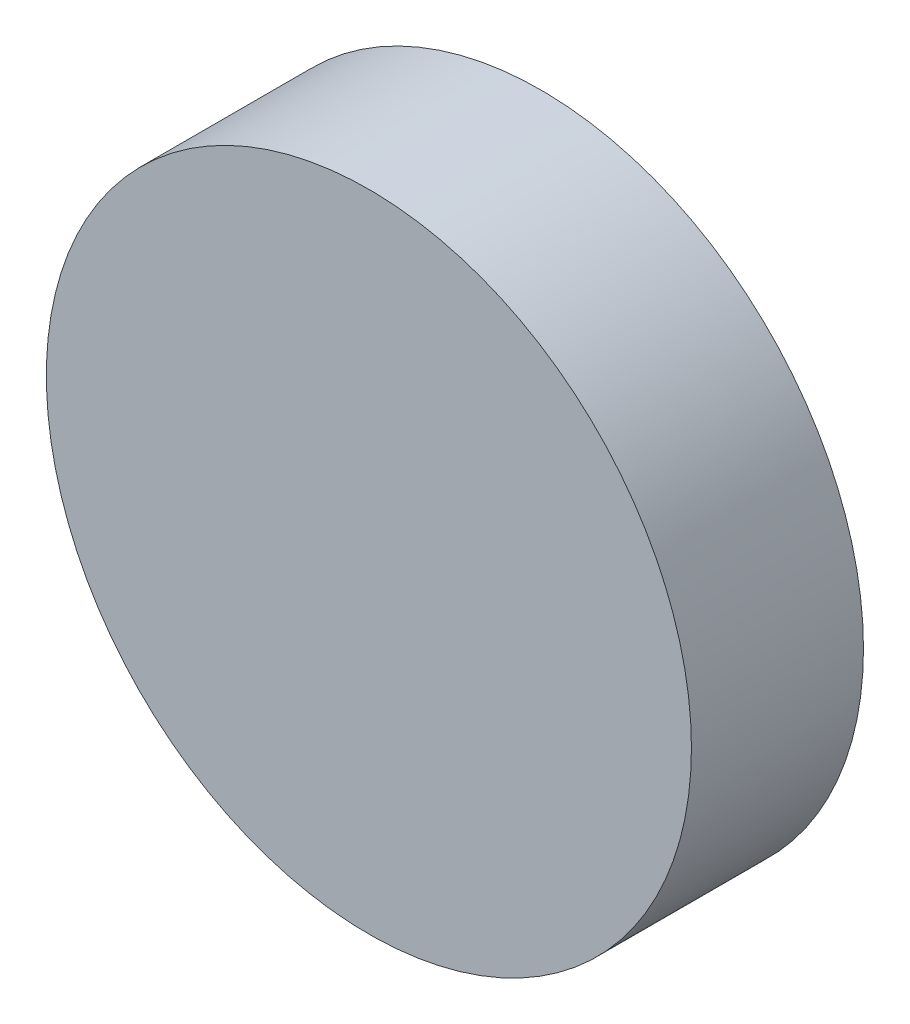
ISO-10303-21;
HEADER;
FILE_DESCRIPTION(('STEP AP214'),'2;1');
FILE_NAME('part.step','',(''),(''),'','','');
FILE_SCHEMA(('AUTOMOTIVE_DESIGN { 1 0 10303 214 1 1 1 1 }'));
ENDSEC;
DATA;
#1=APPLICATION_CONTEXT('core data for automotive mechanical design processes');
#2=APPLICATION_PROTOCOL_DEFINITION('international standard','automotive_design',2000,#1);
#3=PRODUCT_CONTEXT('',#1,'mechanical');
#4=PRODUCT('Part','Part','',(#3));
#5=PRODUCT_RELATED_PRODUCT_CATEGORY('part','',(#4));
#6=PRODUCT_DEFINITION_FORMATION('','',#4);
#7=PRODUCT_DEFINITION_CONTEXT('part definition',#1,'design');
#8=PRODUCT_DEFINITION('design','',#6,#7);
#9=PRODUCT_DEFINITION_SHAPE('','',#8);
#10=(LENGTH_UNIT() NAMED_UNIT(*) SI_UNIT(.MILLI.,.METRE.));
#11=(NAMED_UNIT(*) PLANE_ANGLE_UNIT() SI_UNIT($,.RADIAN.));
#12=(NAMED_UNIT(*) SI_UNIT($,.STERADIAN.) SOLID_ANGLE_UNIT());
#13=UNCERTAINTY_MEASURE_WITH_UNIT(LENGTH_MEASURE(1.E-05),#10,'distance_accuracy_value','');
#14=(GEOMETRIC_REPRESENTATION_CONTEXT(3) GLOBAL_UNCERTAINTY_ASSIGNED_CONTEXT((#13)) GLOBAL_UNIT_ASSIGNED_CONTEXT((#10,
#11,#12)) REPRESENTATION_CONTEXT('',''));
#15=CARTESIAN_POINT('',(0.,0.,0.));
#16=DIRECTION('',(0.,0.,1.));
#17=DIRECTION('',(1.,0.,0.));
#18=AXIS2_PLACEMENT_3D('',#15,#16,#17);
#19=CARTESIAN_POINT('',(0.,0.,2.4));
#20=DIRECTION('',(0.,0.,-1.));
#21=DIRECTION('',(-1.,0.,0.));
#22=AXIS2_PLACEMENT_3D('',#19,#20,#21);
#23=CYLINDRICAL_SURFACE('',#22,4.5);
#24=CARTESIAN_POINT('',(0.,0.,2.4));
#25=DIRECTION('',(0.,0.,1.));
#26=DIRECTION('',(1.,0.,0.));
#27=AXIS2_PLACEMENT_3D('',#24,#25,#26);
#28=CIRCLE('',#27,4.5);
#29=CARTESIAN_POINT('',(4.5,0.,2.4));
#30=VERTEX_POINT('',#29);
#31=EDGE_CURVE('E10',#30,#30,#28,.T.);
#32=ORIENTED_EDGE('',*,*,#31,.F.);
#33=EDGE_LOOP('',(#32));
#34=FACE_BOUND('',#33,.T.);
#35=CARTESIAN_POINT('',(0.,0.,0.));
#36=DIRECTION('',(0.,0.,1.));
#37=DIRECTION('',(1.,0.,0.));
#38=AXIS2_PLACEMENT_3D('',#35,#36,#37);
#39=CIRCLE('',#38,4.5);
#40=CARTESIAN_POINT('',(4.5,0.,0.));
#41=VERTEX_POINT('',#40);
#42=EDGE_CURVE('E34',#41,#41,#39,.T.);
#43=ORIENTED_EDGE('',*,*,#42,.T.);
#44=EDGE_LOOP('',(#43));
#45=FACE_BOUND('',#44,.T.);
#46=ADVANCED_FACE('F31',(#34,#45),#23,.T.);
#47=CARTESIAN_POINT('',(0.,0.,2.4));
#48=DIRECTION('',(0.,0.,1.));
#49=DIRECTION('',(1.,0.,0.));
#50=AXIS2_PLACEMENT_3D('',#47,#48,#49);
#51=PLANE('',#50);
#52=ORIENTED_EDGE('',*,*,#31,.T.);
#53=EDGE_LOOP('',(#52));
#54=FACE_BOUND('',#53,.T.);
#55=ADVANCED_FACE('F68',(#54),#51,.T.);
#56=CARTESIAN_POINT('',(0.,0.,0.));
#57=DIRECTION('',(0.,0.,1.));
#58=DIRECTION('',(1.,0.,0.));
#59=AXIS2_PLACEMENT_3D('',#56,#57,#58);
#60=PLANE('',#59);
#61=CARTESIAN_POINT('',(-2.,0.068183800841542,0.));
#62=DIRECTION('',(0.,0.,-1.));
#63=DIRECTION('',(-1.,0.,0.));
#64=AXIS2_PLACEMENT_3D('',#61,#62,#63);
#65=CIRCLE('',#64,0.5);
#66=CARTESIAN_POINT('',(-2.5,0.068183800841542,0.));
#67=VERTEX_POINT('',#66);
#68=EDGE_CURVE('E49',#67,#67,#65,.T.);
#69=ORIENTED_EDGE('',*,*,#68,.F.);
#70=EDGE_LOOP('',(#69));
#71=FACE_BOUND('',#70,.T.);
#72=CARTESIAN_POINT('',(2.,-0.0552182494723606,0.));
#73=DIRECTION('',(0.,0.,-1.));
#74=DIRECTION('',(-1.,0.,0.));
#75=AXIS2_PLACEMENT_3D('',#72,#73,#74);
#76=CIRCLE('',#75,0.5);
#77=CARTESIAN_POINT('',(1.5,-0.0552182494723606,0.));
#78=VERTEX_POINT('',#77);
#79=EDGE_CURVE('E43',#78,#78,#76,.T.);
#80=ORIENTED_EDGE('',*,*,#79,.F.);
#81=EDGE_LOOP('',(#80));
#82=FACE_BOUND('',#81,.T.);
#83=ORIENTED_EDGE('',*,*,#42,.F.);
#84=EDGE_LOOP('',(#83));
#85=FACE_BOUND('',#84,.T.);
#86=ADVANCED_FACE('F64',(#71,#82,#85),#60,.F.);
#87=CARTESIAN_POINT('',(2.,-0.0552182494723606,0.5));
#88=DIRECTION('',(0.,0.,-1.));
#89=DIRECTION('',(-1.,0.,0.));
#90=AXIS2_PLACEMENT_3D('',#87,#88,#89);
#91=CYLINDRICAL_SURFACE('',#90,0.5);
#92=CARTESIAN_POINT('',(2.,-0.0552182494723606,0.5));
#93=DIRECTION('',(0.,0.,-1.));
#94=DIRECTION('',(-1.,0.,0.));
#95=AXIS2_PLACEMENT_3D('',#92,#93,#94);
#96=CIRCLE('',#95,0.5);
#97=CARTESIAN_POINT('',(1.5,-0.0552182494723606,0.5));
#98=VERTEX_POINT('',#97);
#99=EDGE_CURVE('E46',#98,#98,#96,.T.);
#100=ORIENTED_EDGE('',*,*,#99,.F.);
#101=EDGE_LOOP('',(#100));
#102=FACE_BOUND('',#101,.T.);
#103=ORIENTED_EDGE('',*,*,#79,.T.);
#104=EDGE_LOOP('',(#103));
#105=FACE_BOUND('',#104,.T.);
#106=ADVANCED_FACE('F67',(#102,#105),#91,.F.);
#107=CARTESIAN_POINT('',(2.,-0.0552182494723606,0.5));
#108=DIRECTION('',(0.,0.,-1.));
#109=DIRECTION('',(-1.,0.,0.));
#110=AXIS2_PLACEMENT_3D('',#107,#108,#109);
#111=PLANE('',#110);
#112=ORIENTED_EDGE('',*,*,#99,.T.);
#113=EDGE_LOOP('',(#112));
#114=FACE_BOUND('',#113,.T.);
#115=ADVANCED_FACE('F60',(#114),#111,.T.);
#116=CARTESIAN_POINT('',(-2.,0.068183800841542,0.5));
#117=DIRECTION('',(0.,0.,-1.));
#118=DIRECTION('',(-1.,0.,0.));
#119=AXIS2_PLACEMENT_3D('',#116,#117,#118);
#120=CYLINDRICAL_SURFACE('',#119,0.5);
#121=CARTESIAN_POINT('',(-2.,0.068183800841542,0.5));
#122=DIRECTION('',(0.,0.,-1.));
#123=DIRECTION('',(-1.,0.,0.));
#124=AXIS2_PLACEMENT_3D('',#121,#122,#123);
#125=CIRCLE('',#124,0.5);
#126=CARTESIAN_POINT('',(-2.5,0.068183800841542,0.5));
#127=VERTEX_POINT('',#126);
#128=EDGE_CURVE('E41',#127,#127,#125,.T.);
#129=ORIENTED_EDGE('',*,*,#128,.F.);
#130=EDGE_LOOP('',(#129));
#131=FACE_BOUND('',#130,.T.);
#132=ORIENTED_EDGE('',*,*,#68,.T.);
#133=EDGE_LOOP('',(#132));
#134=FACE_BOUND('',#133,.T.);
#135=ADVANCED_FACE('F57',(#131,#134),#120,.F.);
#136=CARTESIAN_POINT('',(-2.,0.068183800841542,0.5));
#137=DIRECTION('',(0.,0.,-1.));
#138=DIRECTION('',(-1.,0.,0.));
#139=AXIS2_PLACEMENT_3D('',#136,#137,#138);
#140=PLANE('',#139);
#141=ORIENTED_EDGE('',*,*,#128,.T.);
#142=EDGE_LOOP('',(#141));
#143=FACE_BOUND('',#142,.T.);
#144=ADVANCED_FACE('F55',(#143),#140,.T.);
#145=CLOSED_SHELL('',(#46,#55,#86,#106,#115,#135,#144));
#146=MANIFOLD_SOLID_BREP('B2',#145);
#147=ADVANCED_BREP_SHAPE_REPRESENTATION('',(#18,#146),#14);
#148=SHAPE_DEFINITION_REPRESENTATION(#9,#147);
ENDSEC;
END-ISO-10303-21;
